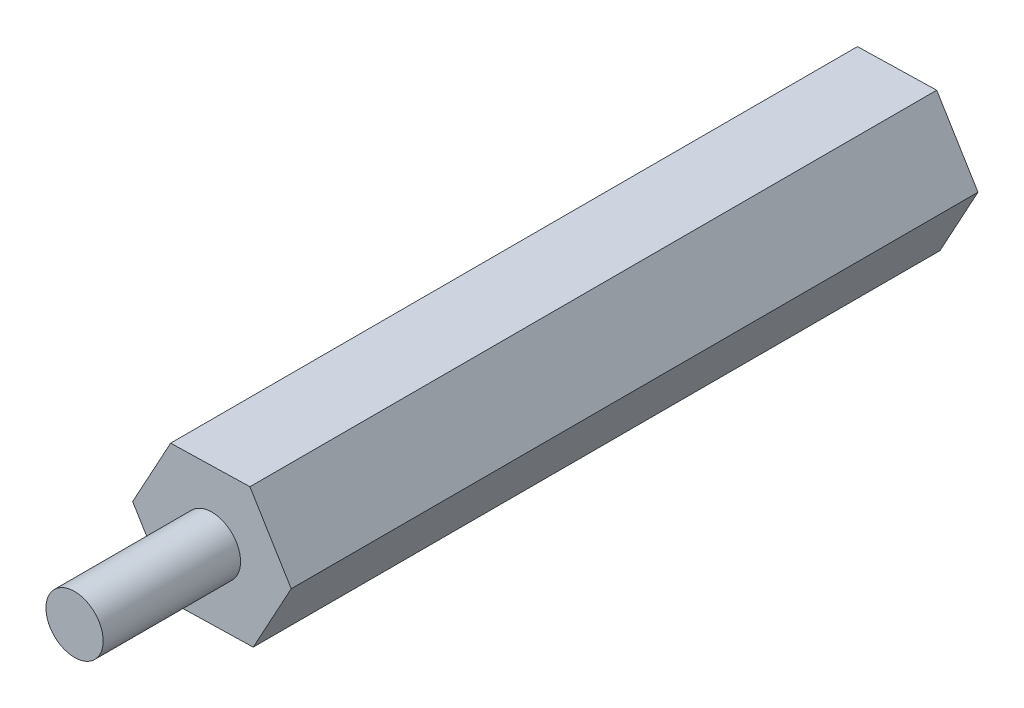
ISO-10303-21;
HEADER;
FILE_DESCRIPTION(('STEP AP214'),'2;1');
FILE_NAME('part.step','',(''),(''),'','','');
FILE_SCHEMA(('AUTOMOTIVE_DESIGN { 1 0 10303 214 1 1 1 1 }'));
ENDSEC;
DATA;
#1=APPLICATION_CONTEXT('core data for automotive mechanical design processes');
#2=APPLICATION_PROTOCOL_DEFINITION('international standard','automotive_design',2000,#1);
#3=PRODUCT_CONTEXT('',#1,'mechanical');
#4=PRODUCT('Part','Part','',(#3));
#5=PRODUCT_RELATED_PRODUCT_CATEGORY('part','',(#4));
#6=PRODUCT_DEFINITION_FORMATION('','',#4);
#7=PRODUCT_DEFINITION_CONTEXT('part definition',#1,'design');
#8=PRODUCT_DEFINITION('design','',#6,#7);
#9=PRODUCT_DEFINITION_SHAPE('','',#8);
#10=(LENGTH_UNIT() NAMED_UNIT(*) SI_UNIT(.MILLI.,.METRE.));
#11=(NAMED_UNIT(*) PLANE_ANGLE_UNIT() SI_UNIT($,.RADIAN.));
#12=(NAMED_UNIT(*) SI_UNIT($,.STERADIAN.) SOLID_ANGLE_UNIT());
#13=UNCERTAINTY_MEASURE_WITH_UNIT(LENGTH_MEASURE(1.E-05),#10,'distance_accuracy_value','');
#14=(GEOMETRIC_REPRESENTATION_CONTEXT(3) GLOBAL_UNCERTAINTY_ASSIGNED_CONTEXT((#13)) GLOBAL_UNIT_ASSIGNED_CONTEXT((#10,
#11,#12)) REPRESENTATION_CONTEXT('',''));
#15=CARTESIAN_POINT('',(0.,0.,0.));
#16=DIRECTION('',(0.,0.,1.));
#17=DIRECTION('',(1.,0.,0.));
#18=AXIS2_PLACEMENT_3D('',#15,#16,#17);
#19=CARTESIAN_POINT('',(3.46311545648785,0.0826518906919286,30.));
#20=DIRECTION('',(-0.853849091286959,-0.520520632932486,0.));
#21=DIRECTION('',(0.520520632932486,-0.853849091286959,0.));
#22=AXIS2_PLACEMENT_3D('',#19,#20,#21);
#23=PLANE('',#22);
#24=DIRECTION('',(-0.520520632932486,0.853849091286959,0.));
#25=VECTOR('',#24,1.);
#26=CARTESIAN_POINT('',(3.46311545648785,0.0826518906919286,0.));
#27=LINE('',#26,#25);
#28=CARTESIAN_POINT('',(3.46311545648785,0.0826518906919286,0.));
#29=VERTEX_POINT('',#28);
#30=CARTESIAN_POINT('',(1.6599790912339,3.04047190690298,0.));
#31=VERTEX_POINT('',#30);
#32=EDGE_CURVE('E129',#29,#31,#27,.T.);
#33=ORIENTED_EDGE('',*,*,#32,.T.);
#34=DIRECTION('',(0.,0.,-1.));
#35=VECTOR('',#34,1.);
#36=CARTESIAN_POINT('',(1.6599790912339,3.04047190690298,30.));
#37=LINE('',#36,#35);
#38=CARTESIAN_POINT('',(1.6599790912339,3.04047190690298,30.));
#39=VERTEX_POINT('',#38);
#40=EDGE_CURVE('E41',#39,#31,#37,.T.);
#41=ORIENTED_EDGE('',*,*,#40,.F.);
#42=DIRECTION('',(-0.520520632932486,0.853849091286959,0.));
#43=VECTOR('',#42,1.);
#44=CARTESIAN_POINT('',(3.46311545648785,0.0826518906919286,30.));
#45=LINE('',#44,#43);
#46=CARTESIAN_POINT('',(3.46311545648785,0.0826518906919286,30.));
#47=VERTEX_POINT('',#46);
#48=EDGE_CURVE('E146',#47,#39,#45,.T.);
#49=ORIENTED_EDGE('',*,*,#48,.F.);
#50=DIRECTION('',(0.,0.,-1.));
#51=VECTOR('',#50,1.);
#52=CARTESIAN_POINT('',(3.46311545648785,0.0826518906919286,30.));
#53=LINE('',#52,#51);
#54=EDGE_CURVE('E125',#47,#29,#53,.T.);
#55=ORIENTED_EDGE('',*,*,#54,.T.);
#56=EDGE_LOOP('',(#33,#41,#49,#55));
#57=FACE_BOUND('',#56,.T.);
#58=ADVANCED_FACE('F38',(#57),#23,.F.);
#59=CARTESIAN_POINT('',(1.6599790912339,3.04047190690298,30.));
#60=DIRECTION('',(0.023859545670008,-0.999715320519007,0.));
#61=DIRECTION('',(0.999715320519007,0.023859545670008,0.));
#62=AXIS2_PLACEMENT_3D('',#59,#60,#61);
#63=PLANE('',#62);
#64=DIRECTION('',(-0.999715320519007,-0.023859545670008,0.));
#65=VECTOR('',#64,1.);
#66=CARTESIAN_POINT('',(1.6599790912339,3.04047190690298,0.));
#67=LINE('',#66,#65);
#68=CARTESIAN_POINT('',(-1.80313636525395,2.95782001621106,0.));
#69=VERTEX_POINT('',#68);
#70=EDGE_CURVE('E133',#31,#69,#67,.T.);
#71=ORIENTED_EDGE('',*,*,#70,.T.);
#72=DIRECTION('',(0.,0.,-1.));
#73=VECTOR('',#72,1.);
#74=CARTESIAN_POINT('',(-1.80313636525395,2.95782001621106,30.));
#75=LINE('',#74,#73);
#76=CARTESIAN_POINT('',(-1.80313636525395,2.95782001621106,30.));
#77=VERTEX_POINT('',#76);
#78=EDGE_CURVE('E152',#77,#69,#75,.T.);
#79=ORIENTED_EDGE('',*,*,#78,.F.);
#80=DIRECTION('',(-0.999715320519007,-0.023859545670008,0.));
#81=VECTOR('',#80,1.);
#82=CARTESIAN_POINT('',(1.6599790912339,3.04047190690298,30.));
#83=LINE('',#82,#81);
#84=EDGE_CURVE('E94',#39,#77,#83,.T.);
#85=ORIENTED_EDGE('',*,*,#84,.F.);
#86=ORIENTED_EDGE('',*,*,#40,.T.);
#87=EDGE_LOOP('',(#71,#79,#85,#86));
#88=FACE_BOUND('',#87,.T.);
#89=ADVANCED_FACE('F159',(#88),#63,.F.);
#90=CARTESIAN_POINT('',(-1.80313636525395,2.95782001621106,30.));
#91=DIRECTION('',(0.877708636956967,-0.479194687586521,0.));
#92=DIRECTION('',(0.479194687586521,0.877708636956967,0.));
#93=AXIS2_PLACEMENT_3D('',#90,#91,#92);
#94=PLANE('',#93);
#95=DIRECTION('',(-0.479194687586521,-0.877708636956967,0.));
#96=VECTOR('',#95,1.);
#97=CARTESIAN_POINT('',(-1.80313636525395,2.95782001621106,0.));
#98=LINE('',#97,#96);
#99=CARTESIAN_POINT('',(-3.46311545648785,-0.0826518906919289,0.));
#100=VERTEX_POINT('',#99);
#101=EDGE_CURVE('E137',#69,#100,#98,.T.);
#102=ORIENTED_EDGE('',*,*,#101,.T.);
#103=DIRECTION('',(0.,0.,-1.));
#104=VECTOR('',#103,1.);
#105=CARTESIAN_POINT('',(-3.46311545648785,-0.0826518906919289,30.));
#106=LINE('',#105,#104);
#107=CARTESIAN_POINT('',(-3.46311545648785,-0.0826518906919289,30.));
#108=VERTEX_POINT('',#107);
#109=EDGE_CURVE('E118',#108,#100,#106,.T.);
#110=ORIENTED_EDGE('',*,*,#109,.F.);
#111=DIRECTION('',(-0.479194687586521,-0.877708636956967,0.));
#112=VECTOR('',#111,1.);
#113=CARTESIAN_POINT('',(-1.80313636525395,2.95782001621106,30.));
#114=LINE('',#113,#112);
#115=EDGE_CURVE('E107',#77,#108,#114,.T.);
#116=ORIENTED_EDGE('',*,*,#115,.F.);
#117=ORIENTED_EDGE('',*,*,#78,.T.);
#118=EDGE_LOOP('',(#102,#110,#116,#117));
#119=FACE_BOUND('',#118,.T.);
#120=ADVANCED_FACE('F165',(#119),#94,.F.);
#121=CARTESIAN_POINT('',(-3.46311545648785,-0.0826518906919289,30.));
#122=DIRECTION('',(0.853849091286958,0.520520632932486,0.));
#123=DIRECTION('',(-0.520520632932486,0.853849091286958,0.));
#124=AXIS2_PLACEMENT_3D('',#121,#122,#123);
#125=PLANE('',#124);
#126=DIRECTION('',(0.520520632932486,-0.853849091286958,0.));
#127=VECTOR('',#126,1.);
#128=CARTESIAN_POINT('',(-3.46311545648785,-0.0826518906919289,0.));
#129=LINE('',#128,#127);
#130=CARTESIAN_POINT('',(-1.6599790912339,-3.04047190690298,0.));
#131=VERTEX_POINT('',#130);
#132=EDGE_CURVE('E116',#100,#131,#129,.T.);
#133=ORIENTED_EDGE('',*,*,#132,.T.);
#134=DIRECTION('',(0.,0.,-1.));
#135=VECTOR('',#134,1.);
#136=CARTESIAN_POINT('',(-1.6599790912339,-3.04047190690298,30.));
#137=LINE('',#136,#135);
#138=CARTESIAN_POINT('',(-1.6599790912339,-3.04047190690298,30.));
#139=VERTEX_POINT('',#138);
#140=EDGE_CURVE('E113',#139,#131,#137,.T.);
#141=ORIENTED_EDGE('',*,*,#140,.F.);
#142=DIRECTION('',(0.520520632932486,-0.853849091286958,0.));
#143=VECTOR('',#142,1.);
#144=CARTESIAN_POINT('',(-3.46311545648785,-0.0826518906919289,30.));
#145=LINE('',#144,#143);
#146=EDGE_CURVE('E101',#108,#139,#145,.T.);
#147=ORIENTED_EDGE('',*,*,#146,.F.);
#148=ORIENTED_EDGE('',*,*,#109,.T.);
#149=EDGE_LOOP('',(#133,#141,#147,#148));
#150=FACE_BOUND('',#149,.T.);
#151=ADVANCED_FACE('F114',(#150),#125,.F.);
#152=CARTESIAN_POINT('',(-1.6599790912339,-3.04047190690298,30.));
#153=DIRECTION('',(-0.0238595456700081,0.999715320519007,0.));
#154=DIRECTION('',(-0.999715320519007,-0.0238595456700081,0.));
#155=AXIS2_PLACEMENT_3D('',#152,#153,#154);
#156=PLANE('',#155);
#157=DIRECTION('',(0.999715320519007,0.0238595456700081,0.));
#158=VECTOR('',#157,1.);
#159=CARTESIAN_POINT('',(-1.6599790912339,-3.04047190690298,0.));
#160=LINE('',#159,#158);
#161=CARTESIAN_POINT('',(1.80313636525395,-2.95782001621106,0.));
#162=VERTEX_POINT('',#161);
#163=EDGE_CURVE('E79',#131,#162,#160,.T.);
#164=ORIENTED_EDGE('',*,*,#163,.T.);
#165=DIRECTION('',(0.,0.,-1.));
#166=VECTOR('',#165,1.);
#167=CARTESIAN_POINT('',(1.80313636525395,-2.95782001621106,30.));
#168=LINE('',#167,#166);
#169=CARTESIAN_POINT('',(1.80313636525395,-2.95782001621106,30.));
#170=VERTEX_POINT('',#169);
#171=EDGE_CURVE('E119',#170,#162,#168,.T.);
#172=ORIENTED_EDGE('',*,*,#171,.F.);
#173=DIRECTION('',(0.999715320519007,0.0238595456700081,0.));
#174=VECTOR('',#173,1.);
#175=CARTESIAN_POINT('',(-1.6599790912339,-3.04047190690298,30.));
#176=LINE('',#175,#174);
#177=EDGE_CURVE('E105',#139,#170,#176,.T.);
#178=ORIENTED_EDGE('',*,*,#177,.F.);
#179=ORIENTED_EDGE('',*,*,#140,.T.);
#180=EDGE_LOOP('',(#164,#172,#178,#179));
#181=FACE_BOUND('',#180,.T.);
#182=ADVANCED_FACE('F121',(#181),#156,.F.);
#183=CARTESIAN_POINT('',(1.80313636525395,-2.95782001621106,30.));
#184=DIRECTION('',(-0.877708636956967,0.479194687586521,0.));
#185=DIRECTION('',(-0.479194687586521,-0.877708636956967,0.));
#186=AXIS2_PLACEMENT_3D('',#183,#184,#185);
#187=PLANE('',#186);
#188=DIRECTION('',(0.479194687586521,0.877708636956967,0.));
#189=VECTOR('',#188,1.);
#190=CARTESIAN_POINT('',(1.80313636525395,-2.95782001621106,0.));
#191=LINE('',#190,#189);
#192=EDGE_CURVE('E85',#162,#29,#191,.T.);
#193=ORIENTED_EDGE('',*,*,#192,.T.);
#194=ORIENTED_EDGE('',*,*,#54,.F.);
#195=DIRECTION('',(0.479194687586521,0.877708636956967,0.));
#196=VECTOR('',#195,1.);
#197=CARTESIAN_POINT('',(1.80313636525395,-2.95782001621106,30.));
#198=LINE('',#197,#196);
#199=EDGE_CURVE('E56',#170,#47,#198,.T.);
#200=ORIENTED_EDGE('',*,*,#199,.F.);
#201=ORIENTED_EDGE('',*,*,#171,.T.);
#202=EDGE_LOOP('',(#193,#194,#200,#201));
#203=FACE_BOUND('',#202,.T.);
#204=ADVANCED_FACE('F204',(#203),#187,.F.);
#205=CARTESIAN_POINT('',(0.,0.,30.));
#206=DIRECTION('',(0.,0.,1.));
#207=DIRECTION('',(1.,0.,0.));
#208=AXIS2_PLACEMENT_3D('',#205,#206,#207);
#209=PLANE('',#208);
#210=CARTESIAN_POINT('',(0.,0.,30.));
#211=DIRECTION('',(0.,0.,1.));
#212=DIRECTION('',(1.,0.,0.));
#213=AXIS2_PLACEMENT_3D('',#210,#211,#212);
#214=CIRCLE('',#213,1.25);
#215=CARTESIAN_POINT('',(1.25,0.,30.));
#216=VERTEX_POINT('',#215);
#217=EDGE_CURVE('E11',#216,#216,#214,.T.);
#218=ORIENTED_EDGE('',*,*,#217,.F.);
#219=EDGE_LOOP('',(#218));
#220=FACE_BOUND('',#219,.T.);
#221=ORIENTED_EDGE('',*,*,#48,.T.);
#222=ORIENTED_EDGE('',*,*,#84,.T.);
#223=ORIENTED_EDGE('',*,*,#115,.T.);
#224=ORIENTED_EDGE('',*,*,#146,.T.);
#225=ORIENTED_EDGE('',*,*,#177,.T.);
#226=ORIENTED_EDGE('',*,*,#199,.T.);
#227=EDGE_LOOP('',(#221,#222,#223,#224,#225,#226));
#228=FACE_BOUND('',#227,.T.);
#229=ADVANCED_FACE('F103',(#220,#228),#209,.T.);
#230=CARTESIAN_POINT('',(0.,0.,0.));
#231=DIRECTION('',(0.,0.,1.));
#232=DIRECTION('',(1.,0.,0.));
#233=AXIS2_PLACEMENT_3D('',#230,#231,#232);
#234=PLANE('',#233);
#235=CARTESIAN_POINT('',(0.,0.,0.));
#236=DIRECTION('',(0.,0.,-1.));
#237=DIRECTION('',(-1.,0.,0.));
#238=AXIS2_PLACEMENT_3D('',#235,#236,#237);
#239=CIRCLE('',#238,1.25);
#240=CARTESIAN_POINT('',(-1.25,0.,0.));
#241=VERTEX_POINT('',#240);
#242=EDGE_CURVE('E176',#241,#241,#239,.T.);
#243=ORIENTED_EDGE('',*,*,#242,.F.);
#244=EDGE_LOOP('',(#243));
#245=FACE_BOUND('',#244,.T.);
#246=ORIENTED_EDGE('',*,*,#32,.F.);
#247=ORIENTED_EDGE('',*,*,#192,.F.);
#248=ORIENTED_EDGE('',*,*,#163,.F.);
#249=ORIENTED_EDGE('',*,*,#132,.F.);
#250=ORIENTED_EDGE('',*,*,#101,.F.);
#251=ORIENTED_EDGE('',*,*,#70,.F.);
#252=EDGE_LOOP('',(#246,#247,#248,#249,#250,#251));
#253=FACE_BOUND('',#252,.T.);
#254=ADVANCED_FACE('F164',(#245,#253),#234,.F.);
#255=CARTESIAN_POINT('',(0.,0.,36.));
#256=DIRECTION('',(0.,0.,-1.));
#257=DIRECTION('',(-1.,0.,0.));
#258=AXIS2_PLACEMENT_3D('',#255,#256,#257);
#259=CYLINDRICAL_SURFACE('',#258,1.25);
#260=CARTESIAN_POINT('',(0.,0.,36.));
#261=DIRECTION('',(0.,0.,1.));
#262=DIRECTION('',(1.,0.,0.));
#263=AXIS2_PLACEMENT_3D('',#260,#261,#262);
#264=CIRCLE('',#263,1.25);
#265=CARTESIAN_POINT('',(1.25,0.,36.));
#266=VERTEX_POINT('',#265);
#267=EDGE_CURVE('E134',#266,#266,#264,.T.);
#268=ORIENTED_EDGE('',*,*,#267,.F.);
#269=EDGE_LOOP('',(#268));
#270=FACE_BOUND('',#269,.T.);
#271=ORIENTED_EDGE('',*,*,#217,.T.);
#272=EDGE_LOOP('',(#271));
#273=FACE_BOUND('',#272,.T.);
#274=ADVANCED_FACE('F194',(#270,#273),#259,.T.);
#275=CARTESIAN_POINT('',(0.,0.,36.));
#276=DIRECTION('',(0.,0.,1.));
#277=DIRECTION('',(1.,0.,0.));
#278=AXIS2_PLACEMENT_3D('',#275,#276,#277);
#279=PLANE('',#278);
#280=ORIENTED_EDGE('',*,*,#267,.T.);
#281=EDGE_LOOP('',(#280));
#282=FACE_BOUND('',#281,.T.);
#283=ADVANCED_FACE('F189',(#282),#279,.T.);
#284=CARTESIAN_POINT('',(0.,0.,20.));
#285=DIRECTION('',(0.,0.,-1.));
#286=DIRECTION('',(-1.,0.,0.));
#287=AXIS2_PLACEMENT_3D('',#284,#285,#286);
#288=CYLINDRICAL_SURFACE('',#287,1.25);
#289=CARTESIAN_POINT('',(0.,0.,20.));
#290=DIRECTION('',(0.,0.,-1.));
#291=DIRECTION('',(-1.,0.,0.));
#292=AXIS2_PLACEMENT_3D('',#289,#290,#291);
#293=CIRCLE('',#292,1.25);
#294=CARTESIAN_POINT('',(-1.25,0.,20.));
#295=VERTEX_POINT('',#294);
#296=EDGE_CURVE('E175',#295,#295,#293,.T.);
#297=ORIENTED_EDGE('',*,*,#296,.F.);
#298=EDGE_LOOP('',(#297));
#299=FACE_BOUND('',#298,.T.);
#300=ORIENTED_EDGE('',*,*,#242,.T.);
#301=EDGE_LOOP('',(#300));
#302=FACE_BOUND('',#301,.T.);
#303=ADVANCED_FACE('F186',(#299,#302),#288,.F.);
#304=CARTESIAN_POINT('',(0.,0.,20.));
#305=DIRECTION('',(0.,0.,-1.));
#306=DIRECTION('',(-1.,0.,0.));
#307=AXIS2_PLACEMENT_3D('',#304,#305,#306);
#308=PLANE('',#307);
#309=ORIENTED_EDGE('',*,*,#296,.T.);
#310=EDGE_LOOP('',(#309));
#311=FACE_BOUND('',#310,.T.);
#312=ADVANCED_FACE('F184',(#311),#308,.T.);
#313=CLOSED_SHELL('',(#58,#89,#120,#151,#182,#204,#229,#254,#274,#283,#303,#312));
#314=MANIFOLD_SOLID_BREP('B2',#313);
#315=ADVANCED_BREP_SHAPE_REPRESENTATION('',(#18,#314),#14);
#316=SHAPE_DEFINITION_REPRESENTATION(#9,#315);
ENDSEC;
END-ISO-10303-21;
